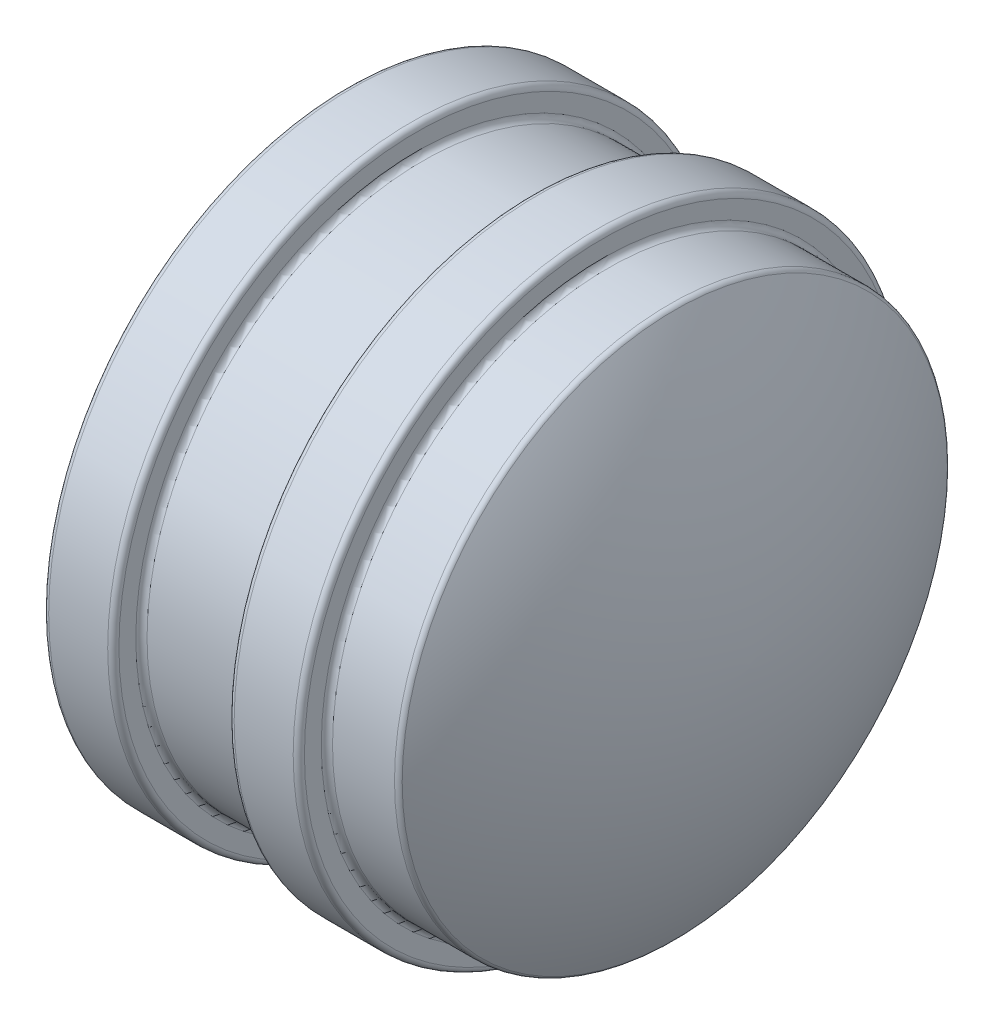
ISO-10303-21;
HEADER;
FILE_DESCRIPTION(('STEP AP214'),'2;1');
FILE_NAME('part.step','',(''),(''),'','','');
FILE_SCHEMA(('AUTOMOTIVE_DESIGN { 1 0 10303 214 1 1 1 1 }'));
ENDSEC;
DATA;
#1=APPLICATION_CONTEXT('core data for automotive mechanical design processes');
#2=APPLICATION_PROTOCOL_DEFINITION('international standard','automotive_design',2000,#1);
#3=PRODUCT_CONTEXT('',#1,'mechanical');
#4=PRODUCT('Part','Part','',(#3));
#5=PRODUCT_RELATED_PRODUCT_CATEGORY('part','',(#4));
#6=PRODUCT_DEFINITION_FORMATION('','',#4);
#7=PRODUCT_DEFINITION_CONTEXT('part definition',#1,'design');
#8=PRODUCT_DEFINITION('design','',#6,#7);
#9=PRODUCT_DEFINITION_SHAPE('','',#8);
#10=(LENGTH_UNIT() NAMED_UNIT(*) SI_UNIT(.MILLI.,.METRE.));
#11=(NAMED_UNIT(*) PLANE_ANGLE_UNIT() SI_UNIT($,.RADIAN.));
#12=(NAMED_UNIT(*) SI_UNIT($,.STERADIAN.) SOLID_ANGLE_UNIT());
#13=UNCERTAINTY_MEASURE_WITH_UNIT(LENGTH_MEASURE(1.E-05),#10,'distance_accuracy_value','');
#14=(GEOMETRIC_REPRESENTATION_CONTEXT(3) GLOBAL_UNCERTAINTY_ASSIGNED_CONTEXT((#13)) GLOBAL_UNIT_ASSIGNED_CONTEXT((#10,
#11,#12)) REPRESENTATION_CONTEXT('',''));
#15=CARTESIAN_POINT('',(0.,0.,0.));
#16=DIRECTION('',(0.,0.,1.));
#17=DIRECTION('',(1.,0.,0.));
#18=AXIS2_PLACEMENT_3D('',#15,#16,#17);
#19=CARTESIAN_POINT('',(0.,13.716,0.));
#20=DIRECTION('',(1.,0.,0.));
#21=DIRECTION('',(0.,0.,-1.));
#22=AXIS2_PLACEMENT_3D('',#19,#20,#21);
#23=PLANE('',#22);
#24=CARTESIAN_POINT('',(0.,-7.112,0.));
#25=DIRECTION('',(1.,0.,0.));
#26=DIRECTION('',(0.,0.,-1.));
#27=AXIS2_PLACEMENT_3D('',#24,#25,#26);
#28=CIRCLE('',#27,2.54);
#29=CARTESIAN_POINT('',(0.,-7.112,-2.54000000000005));
#30=VERTEX_POINT('',#29);
#31=EDGE_CURVE('E199',#30,#30,#28,.T.);
#32=ORIENTED_EDGE('',*,*,#31,.T.);
#33=EDGE_LOOP('',(#32));
#34=FACE_BOUND('',#33,.T.);
#35=CARTESIAN_POINT('',(0.,-5.02894342779868,-5.02894342779877));
#36=DIRECTION('',(1.,0.,0.));
#37=DIRECTION('',(0.,0.,-1.));
#38=AXIS2_PLACEMENT_3D('',#35,#36,#37);
#39=CIRCLE('',#38,2.54);
#40=CARTESIAN_POINT('',(0.,-5.02894342779868,-7.56894342779877));
#41=VERTEX_POINT('',#40);
#42=EDGE_CURVE('E201',#41,#41,#39,.T.);
#43=ORIENTED_EDGE('',*,*,#42,.T.);
#44=EDGE_LOOP('',(#43));
#45=FACE_BOUND('',#44,.T.);
#46=CARTESIAN_POINT('',(0.,0.,-7.112));
#47=DIRECTION('',(1.,0.,0.));
#48=DIRECTION('',(0.,0.,-1.));
#49=AXIS2_PLACEMENT_3D('',#46,#47,#48);
#50=CIRCLE('',#49,2.54);
#51=CARTESIAN_POINT('',(0.,0.,-9.652));
#52=VERTEX_POINT('',#51);
#53=EDGE_CURVE('E204',#52,#52,#50,.T.);
#54=ORIENTED_EDGE('',*,*,#53,.T.);
#55=EDGE_LOOP('',(#54));
#56=FACE_BOUND('',#55,.T.);
#57=CARTESIAN_POINT('',(0.,0.,0.));
#58=DIRECTION('',(1.,0.,0.));
#59=DIRECTION('',(0.,0.,-1.));
#60=AXIS2_PLACEMENT_3D('',#57,#58,#59);
#61=CIRCLE('',#60,2.794);
#62=CARTESIAN_POINT('',(0.,0.,-2.794));
#63=VERTEX_POINT('',#62);
#64=EDGE_CURVE('E207',#63,#63,#61,.T.);
#65=ORIENTED_EDGE('',*,*,#64,.T.);
#66=EDGE_LOOP('',(#65));
#67=FACE_BOUND('',#66,.T.);
#68=CARTESIAN_POINT('',(0.,-5.02894342779875,5.0289434277987));
#69=DIRECTION('',(1.,0.,0.));
#70=DIRECTION('',(0.,0.,-1.));
#71=AXIS2_PLACEMENT_3D('',#68,#69,#70);
#72=CIRCLE('',#71,2.54);
#73=CARTESIAN_POINT('',(0.,-5.02894342779875,2.4889434277987));
#74=VERTEX_POINT('',#73);
#75=EDGE_CURVE('E210',#74,#74,#72,.T.);
#76=ORIENTED_EDGE('',*,*,#75,.T.);
#77=EDGE_LOOP('',(#76));
#78=FACE_BOUND('',#77,.T.);
#79=CARTESIAN_POINT('',(0.,0.,7.112));
#80=DIRECTION('',(1.,0.,0.));
#81=DIRECTION('',(0.,0.,-1.));
#82=AXIS2_PLACEMENT_3D('',#79,#80,#81);
#83=CIRCLE('',#82,2.54);
#84=CARTESIAN_POINT('',(0.,0.,4.572));
#85=VERTEX_POINT('',#84);
#86=EDGE_CURVE('E213',#85,#85,#83,.T.);
#87=ORIENTED_EDGE('',*,*,#86,.T.);
#88=EDGE_LOOP('',(#87));
#89=FACE_BOUND('',#88,.T.);
#90=CARTESIAN_POINT('',(0.,5.02894342779872,5.02894342779874));
#91=DIRECTION('',(1.,0.,0.));
#92=DIRECTION('',(0.,0.,-1.));
#93=AXIS2_PLACEMENT_3D('',#90,#91,#92);
#94=CIRCLE('',#93,2.54);
#95=CARTESIAN_POINT('',(0.,5.02894342779872,2.48894342779874));
#96=VERTEX_POINT('',#95);
#97=EDGE_CURVE('E216',#96,#96,#94,.T.);
#98=ORIENTED_EDGE('',*,*,#97,.T.);
#99=EDGE_LOOP('',(#98));
#100=FACE_BOUND('',#99,.T.);
#101=CARTESIAN_POINT('',(0.,7.112,0.));
#102=DIRECTION('',(1.,0.,0.));
#103=DIRECTION('',(0.,0.,-1.));
#104=AXIS2_PLACEMENT_3D('',#101,#102,#103);
#105=CIRCLE('',#104,2.54);
#106=CARTESIAN_POINT('',(0.,7.112,-2.54));
#107=VERTEX_POINT('',#106);
#108=EDGE_CURVE('E176',#107,#107,#105,.T.);
#109=ORIENTED_EDGE('',*,*,#108,.T.);
#110=EDGE_LOOP('',(#109));
#111=FACE_BOUND('',#110,.T.);
#112=CARTESIAN_POINT('',(0.,5.02894342779879,-5.02894342779866));
#113=DIRECTION('',(1.,0.,0.));
#114=DIRECTION('',(0.,0.,-1.));
#115=AXIS2_PLACEMENT_3D('',#112,#113,#114);
#116=CIRCLE('',#115,2.54);
#117=CARTESIAN_POINT('',(0.,5.02894342779879,-7.56894342779866));
#118=VERTEX_POINT('',#117);
#119=EDGE_CURVE('E220',#118,#118,#116,.T.);
#120=ORIENTED_EDGE('',*,*,#119,.T.);
#121=EDGE_LOOP('',(#120));
#122=FACE_BOUND('',#121,.T.);
#123=CARTESIAN_POINT('',(0.,0.,0.));
#124=DIRECTION('',(1.,0.,0.));
#125=DIRECTION('',(0.,0.,-1.));
#126=AXIS2_PLACEMENT_3D('',#123,#124,#125);
#127=CIRCLE('',#126,13.462);
#128=CARTESIAN_POINT('',(0.,0.,-13.462));
#129=VERTEX_POINT('',#128);
#130=EDGE_CURVE('E280',#129,#129,#127,.F.);
#131=ORIENTED_EDGE('',*,*,#130,.T.);
#132=EDGE_LOOP('',(#131));
#133=FACE_BOUND('',#132,.T.);
#134=ADVANCED_FACE('F32',(#34,#45,#56,#67,#78,#89,#100,#111,#122,#133),#23,.F.);
#135=CARTESIAN_POINT('',(0.,0.,0.));
#136=DIRECTION('',(-1.,0.,0.));
#137=DIRECTION('',(0.,0.,1.));
#138=AXIS2_PLACEMENT_3D('',#135,#136,#137);
#139=CYLINDRICAL_SURFACE('',#138,13.716);
#140=CARTESIAN_POINT('',(2.921,0.,0.));
#141=DIRECTION('',(-1.,0.,0.));
#142=DIRECTION('',(0.,0.,1.));
#143=AXIS2_PLACEMENT_3D('',#140,#141,#142);
#144=CIRCLE('',#143,13.716);
#145=CARTESIAN_POINT('',(2.921,0.,13.716));
#146=VERTEX_POINT('',#145);
#147=EDGE_CURVE('E283',#146,#146,#144,.T.);
#148=ORIENTED_EDGE('',*,*,#147,.T.);
#149=EDGE_LOOP('',(#148));
#150=FACE_BOUND('',#149,.T.);
#151=CARTESIAN_POINT('',(0.25399999999999,0.,0.));
#152=DIRECTION('',(1.,0.,0.));
#153=DIRECTION('',(0.,0.,-1.));
#154=AXIS2_PLACEMENT_3D('',#151,#152,#153);
#155=CIRCLE('',#154,13.716);
#156=CARTESIAN_POINT('',(0.25399999999999,0.,-13.716));
#157=VERTEX_POINT('',#156);
#158=EDGE_CURVE('E286',#157,#157,#155,.T.);
#159=ORIENTED_EDGE('',*,*,#158,.T.);
#160=EDGE_LOOP('',(#159));
#161=FACE_BOUND('',#160,.T.);
#162=ADVANCED_FACE('F61',(#150,#161),#139,.T.);
#163=CARTESIAN_POINT('',(3.175,12.446,0.));
#164=DIRECTION('',(-1.,0.,0.));
#165=DIRECTION('',(0.,0.,1.));
#166=AXIS2_PLACEMENT_3D('',#163,#164,#165);
#167=PLANE('',#166);
#168=CARTESIAN_POINT('',(3.175,0.,0.));
#169=DIRECTION('',(-1.,0.,0.));
#170=DIRECTION('',(0.,0.,1.));
#171=AXIS2_PLACEMENT_3D('',#168,#169,#170);
#172=CIRCLE('',#171,12.7);
#173=CARTESIAN_POINT('',(3.175,0.,12.7));
#174=VERTEX_POINT('',#173);
#175=EDGE_CURVE('E289',#174,#174,#172,.T.);
#176=ORIENTED_EDGE('',*,*,#175,.T.);
#177=EDGE_LOOP('',(#176));
#178=FACE_BOUND('',#177,.T.);
#179=CARTESIAN_POINT('',(3.175,0.,0.));
#180=DIRECTION('',(-1.,0.,0.));
#181=DIRECTION('',(0.,0.,1.));
#182=AXIS2_PLACEMENT_3D('',#179,#180,#181);
#183=CIRCLE('',#182,13.462);
#184=CARTESIAN_POINT('',(3.175,0.,13.462));
#185=VERTEX_POINT('',#184);
#186=EDGE_CURVE('E292',#185,#185,#183,.F.);
#187=ORIENTED_EDGE('',*,*,#186,.T.);
#188=EDGE_LOOP('',(#187));
#189=FACE_BOUND('',#188,.T.);
#190=ADVANCED_FACE('F67',(#178,#189),#167,.F.);
#191=CARTESIAN_POINT('',(0.,0.,0.));
#192=DIRECTION('',(-1.,0.,0.));
#193=DIRECTION('',(0.,0.,1.));
#194=AXIS2_PLACEMENT_3D('',#191,#192,#193);
#195=CYLINDRICAL_SURFACE('',#194,12.446);
#196=CARTESIAN_POINT('',(8.128,0.,0.));
#197=DIRECTION('',(1.,0.,0.));
#198=DIRECTION('',(0.,0.,-1.));
#199=AXIS2_PLACEMENT_3D('',#196,#197,#198);
#200=CIRCLE('',#199,12.446);
#201=CARTESIAN_POINT('',(8.128,0.,-12.446));
#202=VERTEX_POINT('',#201);
#203=EDGE_CURVE('E295',#202,#202,#200,.F.);
#204=ORIENTED_EDGE('',*,*,#203,.T.);
#205=EDGE_LOOP('',(#204));
#206=FACE_BOUND('',#205,.T.);
#207=CARTESIAN_POINT('',(3.429,0.,0.));
#208=DIRECTION('',(-1.,0.,0.));
#209=DIRECTION('',(0.,0.,1.));
#210=AXIS2_PLACEMENT_3D('',#207,#208,#209);
#211=CIRCLE('',#210,12.446);
#212=CARTESIAN_POINT('',(3.429,0.,12.446));
#213=VERTEX_POINT('',#212);
#214=EDGE_CURVE('E298',#213,#213,#211,.F.);
#215=ORIENTED_EDGE('',*,*,#214,.T.);
#216=EDGE_LOOP('',(#215));
#217=FACE_BOUND('',#216,.T.);
#218=ADVANCED_FACE('F349',(#206,#217),#195,.T.);
#219=CARTESIAN_POINT('',(8.382,13.716,0.));
#220=DIRECTION('',(1.,0.,0.));
#221=DIRECTION('',(0.,0.,-1.));
#222=AXIS2_PLACEMENT_3D('',#219,#220,#221);
#223=PLANE('',#222);
#224=CARTESIAN_POINT('',(8.382,0.,0.));
#225=DIRECTION('',(1.,0.,0.));
#226=DIRECTION('',(0.,0.,-1.));
#227=AXIS2_PLACEMENT_3D('',#224,#225,#226);
#228=CIRCLE('',#227,13.462);
#229=CARTESIAN_POINT('',(8.382,0.,-13.462));
#230=VERTEX_POINT('',#229);
#231=EDGE_CURVE('E301',#230,#230,#228,.F.);
#232=ORIENTED_EDGE('',*,*,#231,.T.);
#233=EDGE_LOOP('',(#232));
#234=FACE_BOUND('',#233,.T.);
#235=CARTESIAN_POINT('',(8.382,0.,0.));
#236=DIRECTION('',(1.,0.,0.));
#237=DIRECTION('',(0.,0.,-1.));
#238=AXIS2_PLACEMENT_3D('',#235,#236,#237);
#239=CIRCLE('',#238,12.7);
#240=CARTESIAN_POINT('',(8.382,0.,-12.7));
#241=VERTEX_POINT('',#240);
#242=EDGE_CURVE('E304',#241,#241,#239,.T.);
#243=ORIENTED_EDGE('',*,*,#242,.T.);
#244=EDGE_LOOP('',(#243));
#245=FACE_BOUND('',#244,.T.);
#246=ADVANCED_FACE('F341',(#234,#245),#223,.F.);
#247=CARTESIAN_POINT('',(0.,0.,0.));
#248=DIRECTION('',(-1.,0.,0.));
#249=DIRECTION('',(0.,0.,1.));
#250=AXIS2_PLACEMENT_3D('',#247,#248,#249);
#251=CYLINDRICAL_SURFACE('',#250,13.716);
#252=CARTESIAN_POINT('',(11.303,0.,0.));
#253=DIRECTION('',(-1.,0.,0.));
#254=DIRECTION('',(0.,0.,1.));
#255=AXIS2_PLACEMENT_3D('',#252,#253,#254);
#256=CIRCLE('',#255,13.716);
#257=CARTESIAN_POINT('',(11.303,0.,13.716));
#258=VERTEX_POINT('',#257);
#259=EDGE_CURVE('E307',#258,#258,#256,.T.);
#260=ORIENTED_EDGE('',*,*,#259,.T.);
#261=EDGE_LOOP('',(#260));
#262=FACE_BOUND('',#261,.T.);
#263=CARTESIAN_POINT('',(8.636,0.,0.));
#264=DIRECTION('',(1.,0.,0.));
#265=DIRECTION('',(0.,0.,-1.));
#266=AXIS2_PLACEMENT_3D('',#263,#264,#265);
#267=CIRCLE('',#266,13.716);
#268=CARTESIAN_POINT('',(8.636,0.,-13.716));
#269=VERTEX_POINT('',#268);
#270=EDGE_CURVE('E310',#269,#269,#267,.T.);
#271=ORIENTED_EDGE('',*,*,#270,.T.);
#272=EDGE_LOOP('',(#271));
#273=FACE_BOUND('',#272,.T.);
#274=ADVANCED_FACE('F333',(#262,#273),#251,.T.);
#275=CARTESIAN_POINT('',(11.557,12.446,0.));
#276=DIRECTION('',(-1.,0.,0.));
#277=DIRECTION('',(0.,0.,1.));
#278=AXIS2_PLACEMENT_3D('',#275,#276,#277);
#279=PLANE('',#278);
#280=CARTESIAN_POINT('',(11.557,0.,0.));
#281=DIRECTION('',(-1.,0.,0.));
#282=DIRECTION('',(0.,0.,1.));
#283=AXIS2_PLACEMENT_3D('',#280,#281,#282);
#284=CIRCLE('',#283,12.7);
#285=CARTESIAN_POINT('',(11.557,0.,12.7));
#286=VERTEX_POINT('',#285);
#287=EDGE_CURVE('E313',#286,#286,#284,.T.);
#288=ORIENTED_EDGE('',*,*,#287,.T.);
#289=EDGE_LOOP('',(#288));
#290=FACE_BOUND('',#289,.T.);
#291=CARTESIAN_POINT('',(11.557,0.,0.));
#292=DIRECTION('',(-1.,0.,0.));
#293=DIRECTION('',(0.,0.,1.));
#294=AXIS2_PLACEMENT_3D('',#291,#292,#293);
#295=CIRCLE('',#294,13.462);
#296=CARTESIAN_POINT('',(11.557,0.,13.462));
#297=VERTEX_POINT('',#296);
#298=EDGE_CURVE('E316',#297,#297,#295,.F.);
#299=ORIENTED_EDGE('',*,*,#298,.T.);
#300=EDGE_LOOP('',(#299));
#301=FACE_BOUND('',#300,.T.);
#302=ADVANCED_FACE('F55',(#290,#301),#279,.F.);
#303=CARTESIAN_POINT('',(0.,0.,0.));
#304=DIRECTION('',(-1.,0.,0.));
#305=DIRECTION('',(0.,0.,1.));
#306=AXIS2_PLACEMENT_3D('',#303,#304,#305);
#307=CYLINDRICAL_SURFACE('',#306,12.446);
#308=CARTESIAN_POINT('',(14.6106330774353,0.,0.));
#309=DIRECTION('',(1.,0.,0.));
#310=DIRECTION('',(0.,0.,-1.));
#311=AXIS2_PLACEMENT_3D('',#308,#309,#310);
#312=CIRCLE('',#311,12.446);
#313=CARTESIAN_POINT('',(14.6106330774353,0.,-12.446));
#314=VERTEX_POINT('',#313);
#315=EDGE_CURVE('E321',#314,#314,#312,.F.);
#316=ORIENTED_EDGE('',*,*,#315,.T.);
#317=EDGE_LOOP('',(#316));
#318=FACE_BOUND('',#317,.T.);
#319=CARTESIAN_POINT('',(11.811,0.,0.));
#320=DIRECTION('',(-1.,0.,0.));
#321=DIRECTION('',(0.,0.,1.));
#322=AXIS2_PLACEMENT_3D('',#319,#320,#321);
#323=CIRCLE('',#322,12.446);
#324=CARTESIAN_POINT('',(11.811,0.,12.446));
#325=VERTEX_POINT('',#324);
#326=EDGE_CURVE('E324',#325,#325,#323,.F.);
#327=ORIENTED_EDGE('',*,*,#326,.T.);
#328=EDGE_LOOP('',(#327));
#329=FACE_BOUND('',#328,.T.);
#330=ADVANCED_FACE('F45',(#318,#329),#307,.T.);
#331=CARTESIAN_POINT('',(-7.21180336977641,0.,-0.302101948815966));
#332=DIRECTION('',(0.,-1.,0.));
#333=DIRECTION('',(0.,0.,1.));
#334=AXIS2_PLACEMENT_3D('',#331,#332,#333);
#335=CIRCLE('',#334,25.4);
#336=TRIMMED_CURVE('',#335,(PARAMETER_VALUE(-1.55890226884512)),
(PARAMETER_VALUE(1.55890226884512)),.T.,.PARAMETER.);
#337=CARTESIAN_POINT('',(-7.21180336977641,0.,0.));
#338=DIRECTION('',(-1.,0.,0.));
#339=AXIS1_PLACEMENT('',#337,#338);
#340=SURFACE_OF_REVOLUTION('',#336,#339);
#341=CARTESIAN_POINT('',(14.8310617284172,0.,0.));
#342=DIRECTION('',(-1.,0.,0.));
#343=DIRECTION('',(0.,0.,1.));
#344=AXIS2_PLACEMENT_3D('',#341,#342,#343);
#345=CIRCLE('',#344,12.3182030499881);
#346=CARTESIAN_POINT('',(14.8310617284172,0.,12.3182030499881));
#347=VERTEX_POINT('',#346);
#348=EDGE_CURVE('E319',#347,#347,#345,.F.);
#349=ORIENTED_EDGE('',*,*,#348,.T.);
#350=EDGE_LOOP('',(#349));
#351=FACE_BOUND('',#350,.T.);
#352=CARTESIAN_POINT('',(18.1864,0.,0.));
#353=VERTEX_POINT('',#352);
#354=VERTEX_LOOP('',#353);
#355=FACE_BOUND('',#354,.T.);
#356=ADVANCED_FACE('F42',(#351,#355),#340,.T.);
#357=CARTESIAN_POINT('',(14.6106330774353,0.,0.));
#358=DIRECTION('',(1.,0.,0.));
#359=DIRECTION('',(0.,0.,-1.));
#360=AXIS2_PLACEMENT_3D('',#357,#358,#359);
#361=TOROIDAL_SURFACE('',#360,12.192,0.254);
#362=ORIENTED_EDGE('',*,*,#348,.F.);
#363=EDGE_LOOP('',(#362));
#364=FACE_BOUND('',#363,.T.);
#365=ORIENTED_EDGE('',*,*,#315,.F.);
#366=EDGE_LOOP('',(#365));
#367=FACE_BOUND('',#366,.T.);
#368=ADVANCED_FACE('F44',(#364,#367),#361,.T.);
#369=CARTESIAN_POINT('',(11.811,0.,0.));
#370=DIRECTION('',(-1.,0.,0.));
#371=DIRECTION('',(0.,0.,1.));
#372=AXIS2_PLACEMENT_3D('',#369,#370,#371);
#373=TOROIDAL_SURFACE('',#372,12.7,0.254);
#374=ORIENTED_EDGE('',*,*,#326,.F.);
#375=EDGE_LOOP('',(#374));
#376=FACE_BOUND('',#375,.T.);
#377=ORIENTED_EDGE('',*,*,#287,.F.);
#378=EDGE_LOOP('',(#377));
#379=FACE_BOUND('',#378,.T.);
#380=ADVANCED_FACE('F52',(#376,#379),#373,.F.);
#381=CARTESIAN_POINT('',(11.303,0.,0.));
#382=DIRECTION('',(-1.,0.,0.));
#383=DIRECTION('',(0.,0.,1.));
#384=AXIS2_PLACEMENT_3D('',#381,#382,#383);
#385=TOROIDAL_SURFACE('',#384,13.462,0.254);
#386=ORIENTED_EDGE('',*,*,#298,.F.);
#387=EDGE_LOOP('',(#386));
#388=FACE_BOUND('',#387,.T.);
#389=ORIENTED_EDGE('',*,*,#259,.F.);
#390=EDGE_LOOP('',(#389));
#391=FACE_BOUND('',#390,.T.);
#392=ADVANCED_FACE('F76',(#388,#391),#385,.T.);
#393=CARTESIAN_POINT('',(8.636,0.,0.));
#394=DIRECTION('',(1.,0.,0.));
#395=DIRECTION('',(0.,0.,-1.));
#396=AXIS2_PLACEMENT_3D('',#393,#394,#395);
#397=TOROIDAL_SURFACE('',#396,13.462,0.254);
#398=ORIENTED_EDGE('',*,*,#270,.F.);
#399=EDGE_LOOP('',(#398));
#400=FACE_BOUND('',#399,.T.);
#401=ORIENTED_EDGE('',*,*,#231,.F.);
#402=EDGE_LOOP('',(#401));
#403=FACE_BOUND('',#402,.T.);
#404=ADVANCED_FACE('F80',(#400,#403),#397,.T.);
#405=CARTESIAN_POINT('',(8.128,0.,0.));
#406=DIRECTION('',(1.,0.,0.));
#407=DIRECTION('',(0.,0.,-1.));
#408=AXIS2_PLACEMENT_3D('',#405,#406,#407);
#409=TOROIDAL_SURFACE('',#408,12.7,0.254);
#410=ORIENTED_EDGE('',*,*,#242,.F.);
#411=EDGE_LOOP('',(#410));
#412=FACE_BOUND('',#411,.T.);
#413=ORIENTED_EDGE('',*,*,#203,.F.);
#414=EDGE_LOOP('',(#413));
#415=FACE_BOUND('',#414,.T.);
#416=ADVANCED_FACE('F84',(#412,#415),#409,.F.);
#417=CARTESIAN_POINT('',(3.429,0.,0.));
#418=DIRECTION('',(-1.,0.,0.));
#419=DIRECTION('',(0.,0.,1.));
#420=AXIS2_PLACEMENT_3D('',#417,#418,#419);
#421=TOROIDAL_SURFACE('',#420,12.7,0.254);
#422=ORIENTED_EDGE('',*,*,#214,.F.);
#423=EDGE_LOOP('',(#422));
#424=FACE_BOUND('',#423,.T.);
#425=ORIENTED_EDGE('',*,*,#175,.F.);
#426=EDGE_LOOP('',(#425));
#427=FACE_BOUND('',#426,.T.);
#428=ADVANCED_FACE('F88',(#424,#427),#421,.F.);
#429=CARTESIAN_POINT('',(2.921,0.,0.));
#430=DIRECTION('',(-1.,0.,0.));
#431=DIRECTION('',(0.,0.,1.));
#432=AXIS2_PLACEMENT_3D('',#429,#430,#431);
#433=TOROIDAL_SURFACE('',#432,13.462,0.254);
#434=ORIENTED_EDGE('',*,*,#186,.F.);
#435=EDGE_LOOP('',(#434));
#436=FACE_BOUND('',#435,.T.);
#437=ORIENTED_EDGE('',*,*,#147,.F.);
#438=EDGE_LOOP('',(#437));
#439=FACE_BOUND('',#438,.T.);
#440=ADVANCED_FACE('F92',(#436,#439),#433,.T.);
#441=CARTESIAN_POINT('',(0.25399999999999,0.,0.));
#442=DIRECTION('',(1.,0.,0.));
#443=DIRECTION('',(0.,0.,-1.));
#444=AXIS2_PLACEMENT_3D('',#441,#442,#443);
#445=TOROIDAL_SURFACE('',#444,13.462,0.254);
#446=ORIENTED_EDGE('',*,*,#158,.F.);
#447=EDGE_LOOP('',(#446));
#448=FACE_BOUND('',#447,.T.);
#449=ORIENTED_EDGE('',*,*,#130,.F.);
#450=EDGE_LOOP('',(#449));
#451=FACE_BOUND('',#450,.T.);
#452=ADVANCED_FACE('F96',(#448,#451),#445,.T.);
#453=CARTESIAN_POINT('',(6.35,0.,0.));
#454=DIRECTION('',(-1.,0.,0.));
#455=DIRECTION('',(0.,0.,1.));
#456=AXIS2_PLACEMENT_3D('',#453,#454,#455);
#457=CYLINDRICAL_SURFACE('',#456,2.54);
#458=CARTESIAN_POINT('',(0.253999999999989,0.,0.));
#459=DIRECTION('',(1.,0.,0.));
#460=DIRECTION('',(0.,0.,-1.));
#461=AXIS2_PLACEMENT_3D('',#458,#459,#460);
#462=CIRCLE('',#461,2.54);
#463=CARTESIAN_POINT('',(0.253999999999989,0.,-2.54));
#464=VERTEX_POINT('',#463);
#465=EDGE_CURVE('E190',#464,#464,#462,.F.);
#466=ORIENTED_EDGE('',*,*,#465,.T.);
#467=EDGE_LOOP('',(#466));
#468=FACE_BOUND('',#467,.T.);
#469=CARTESIAN_POINT('',(5.08,0.,0.));
#470=DIRECTION('',(-1.,0.,0.));
#471=DIRECTION('',(0.,0.,1.));
#472=AXIS2_PLACEMENT_3D('',#469,#470,#471);
#473=CIRCLE('',#472,2.54);
#474=CARTESIAN_POINT('',(5.08,0.,2.54));
#475=VERTEX_POINT('',#474);
#476=EDGE_CURVE('E250',#475,#475,#473,.F.);
#477=ORIENTED_EDGE('',*,*,#476,.T.);
#478=EDGE_LOOP('',(#477));
#479=FACE_BOUND('',#478,.T.);
#480=ADVANCED_FACE('F100',(#468,#479),#457,.F.);
#481=CARTESIAN_POINT('',(6.35,0.,0.));
#482=DIRECTION('',(-1.,0.,0.));
#483=DIRECTION('',(0.,0.,1.));
#484=AXIS2_PLACEMENT_3D('',#481,#482,#483);
#485=PLANE('',#484);
#486=CARTESIAN_POINT('',(6.35,0.,0.));
#487=DIRECTION('',(-1.,0.,0.));
#488=DIRECTION('',(0.,0.,1.));
#489=AXIS2_PLACEMENT_3D('',#486,#487,#488);
#490=CIRCLE('',#489,1.27);
#491=CARTESIAN_POINT('',(6.35,0.,1.27));
#492=VERTEX_POINT('',#491);
#493=EDGE_CURVE('E253',#492,#492,#490,.T.);
#494=ORIENTED_EDGE('',*,*,#493,.T.);
#495=EDGE_LOOP('',(#494));
#496=FACE_BOUND('',#495,.T.);
#497=ADVANCED_FACE('F455',(#496),#485,.T.);
#498=CARTESIAN_POINT('',(6.35,7.112,0.));
#499=DIRECTION('',(-1.,0.,0.));
#500=DIRECTION('',(0.,0.,1.));
#501=AXIS2_PLACEMENT_3D('',#498,#499,#500);
#502=CYLINDRICAL_SURFACE('',#501,2.286);
#503=CARTESIAN_POINT('',(0.253999999999989,7.112,0.));
#504=DIRECTION('',(1.,0.,0.));
#505=DIRECTION('',(0.,0.,-1.));
#506=AXIS2_PLACEMENT_3D('',#503,#504,#505);
#507=CIRCLE('',#506,2.286);
#508=CARTESIAN_POINT('',(0.253999999999989,7.112,-2.286));
#509=VERTEX_POINT('',#508);
#510=EDGE_CURVE('E39',#509,#509,#507,.F.);
#511=ORIENTED_EDGE('',*,*,#510,.T.);
#512=EDGE_LOOP('',(#511));
#513=FACE_BOUND('',#512,.T.);
#514=CARTESIAN_POINT('',(5.08,7.112,0.));
#515=DIRECTION('',(-1.,0.,0.));
#516=DIRECTION('',(0.,0.,1.));
#517=AXIS2_PLACEMENT_3D('',#514,#515,#516);
#518=CIRCLE('',#517,2.286);
#519=CARTESIAN_POINT('',(5.08,7.112,2.286));
#520=VERTEX_POINT('',#519);
#521=EDGE_CURVE('E232',#520,#520,#518,.F.);
#522=ORIENTED_EDGE('',*,*,#521,.T.);
#523=EDGE_LOOP('',(#522));
#524=FACE_BOUND('',#523,.T.);
#525=ADVANCED_FACE('F460',(#513,#524),#502,.F.);
#526=CARTESIAN_POINT('',(6.35,7.112,0.));
#527=DIRECTION('',(-1.,0.,0.));
#528=DIRECTION('',(0.,0.,1.));
#529=AXIS2_PLACEMENT_3D('',#526,#527,#528);
#530=PLANE('',#529);
#531=CARTESIAN_POINT('',(6.35,7.112,0.));
#532=DIRECTION('',(-1.,0.,0.));
#533=DIRECTION('',(0.,0.,1.));
#534=AXIS2_PLACEMENT_3D('',#531,#532,#533);
#535=CIRCLE('',#534,1.016);
#536=CARTESIAN_POINT('',(6.35,7.112,1.016));
#537=VERTEX_POINT('',#536);
#538=EDGE_CURVE('E235',#537,#537,#535,.T.);
#539=ORIENTED_EDGE('',*,*,#538,.T.);
#540=EDGE_LOOP('',(#539));
#541=FACE_BOUND('',#540,.T.);
#542=ADVANCED_FACE('F468',(#541),#530,.T.);
#543=CARTESIAN_POINT('',(6.35,5.02894342779872,5.02894342779874));
#544=DIRECTION('',(-1.,0.,0.));
#545=DIRECTION('',(0.,0.,1.));
#546=AXIS2_PLACEMENT_3D('',#543,#544,#545);
#547=CYLINDRICAL_SURFACE('',#546,2.286);
#548=CARTESIAN_POINT('',(0.253999999999989,5.02894342779872,5.02894342779874));
#549=DIRECTION('',(1.,0.,0.));
#550=DIRECTION('',(0.,0.,-1.));
#551=AXIS2_PLACEMENT_3D('',#548,#549,#550);
#552=CIRCLE('',#551,2.286);
#553=CARTESIAN_POINT('',(0.253999999999989,5.02894342779872,2.74294342779874));
#554=VERTEX_POINT('',#553);
#555=EDGE_CURVE('E180',#554,#554,#552,.F.);
#556=ORIENTED_EDGE('',*,*,#555,.T.);
#557=EDGE_LOOP('',(#556));
#558=FACE_BOUND('',#557,.T.);
#559=CARTESIAN_POINT('',(5.08,5.02894342779872,5.02894342779874));
#560=DIRECTION('',(-1.,0.,0.));
#561=DIRECTION('',(0.,0.,1.));
#562=AXIS2_PLACEMENT_3D('',#559,#560,#561);
#563=CIRCLE('',#562,2.286);
#564=CARTESIAN_POINT('',(5.08,5.02894342779872,7.31494342779873));
#565=VERTEX_POINT('',#564);
#566=EDGE_CURVE('E256',#565,#565,#563,.F.);
#567=ORIENTED_EDGE('',*,*,#566,.T.);
#568=EDGE_LOOP('',(#567));
#569=FACE_BOUND('',#568,.T.);
#570=ADVANCED_FACE('F473',(#558,#569),#547,.F.);
#571=CARTESIAN_POINT('',(6.35,5.02894342779872,5.02894342779874));
#572=DIRECTION('',(-1.,0.,0.));
#573=DIRECTION('',(0.,0.,1.));
#574=AXIS2_PLACEMENT_3D('',#571,#572,#573);
#575=PLANE('',#574);
#576=CARTESIAN_POINT('',(6.35,5.02894342779872,5.02894342779874));
#577=DIRECTION('',(-1.,0.,0.));
#578=DIRECTION('',(0.,0.,1.));
#579=AXIS2_PLACEMENT_3D('',#576,#577,#578);
#580=CIRCLE('',#579,1.016);
#581=CARTESIAN_POINT('',(6.35,5.02894342779872,6.04494342779873));
#582=VERTEX_POINT('',#581);
#583=EDGE_CURVE('E259',#582,#582,#580,.T.);
#584=ORIENTED_EDGE('',*,*,#583,.T.);
#585=EDGE_LOOP('',(#584));
#586=FACE_BOUND('',#585,.T.);
#587=ADVANCED_FACE('F481',(#586),#575,.T.);
#588=CARTESIAN_POINT('',(6.35,0.,7.112));
#589=DIRECTION('',(-1.,0.,0.));
#590=DIRECTION('',(0.,0.,1.));
#591=AXIS2_PLACEMENT_3D('',#588,#589,#590);
#592=CYLINDRICAL_SURFACE('',#591,2.286);
#593=CARTESIAN_POINT('',(0.253999999999989,0.,7.112));
#594=DIRECTION('',(1.,0.,0.));
#595=DIRECTION('',(0.,0.,-1.));
#596=AXIS2_PLACEMENT_3D('',#593,#594,#595);
#597=CIRCLE('',#596,2.286);
#598=CARTESIAN_POINT('',(0.253999999999989,0.,4.826));
#599=VERTEX_POINT('',#598);
#600=EDGE_CURVE('E182',#599,#599,#597,.F.);
#601=ORIENTED_EDGE('',*,*,#600,.T.);
#602=EDGE_LOOP('',(#601));
#603=FACE_BOUND('',#602,.T.);
#604=CARTESIAN_POINT('',(5.08,0.,7.112));
#605=DIRECTION('',(-1.,0.,0.));
#606=DIRECTION('',(0.,0.,1.));
#607=AXIS2_PLACEMENT_3D('',#604,#605,#606);
#608=CIRCLE('',#607,2.286);
#609=CARTESIAN_POINT('',(5.08,0.,9.398));
#610=VERTEX_POINT('',#609);
#611=EDGE_CURVE('E262',#610,#610,#608,.F.);
#612=ORIENTED_EDGE('',*,*,#611,.T.);
#613=EDGE_LOOP('',(#612));
#614=FACE_BOUND('',#613,.T.);
#615=ADVANCED_FACE('F486',(#603,#614),#592,.F.);
#616=CARTESIAN_POINT('',(6.35,0.,7.112));
#617=DIRECTION('',(-1.,0.,0.));
#618=DIRECTION('',(0.,0.,1.));
#619=AXIS2_PLACEMENT_3D('',#616,#617,#618);
#620=PLANE('',#619);
#621=CARTESIAN_POINT('',(6.35,0.,7.112));
#622=DIRECTION('',(-1.,0.,0.));
#623=DIRECTION('',(0.,0.,1.));
#624=AXIS2_PLACEMENT_3D('',#621,#622,#623);
#625=CIRCLE('',#624,1.016);
#626=CARTESIAN_POINT('',(6.35,0.,8.128));
#627=VERTEX_POINT('',#626);
#628=EDGE_CURVE('E265',#627,#627,#625,.T.);
#629=ORIENTED_EDGE('',*,*,#628,.T.);
#630=EDGE_LOOP('',(#629));
#631=FACE_BOUND('',#630,.T.);
#632=ADVANCED_FACE('F494',(#631),#620,.T.);
#633=CARTESIAN_POINT('',(6.35,-5.02894342779875,5.0289434277987));
#634=DIRECTION('',(-1.,0.,0.));
#635=DIRECTION('',(0.,0.,1.));
#636=AXIS2_PLACEMENT_3D('',#633,#634,#635);
#637=CYLINDRICAL_SURFACE('',#636,2.286);
#638=CARTESIAN_POINT('',(0.253999999999989,-5.02894342779875,5.0289434277987));
#639=DIRECTION('',(1.,0.,0.));
#640=DIRECTION('',(0.,0.,-1.));
#641=AXIS2_PLACEMENT_3D('',#638,#639,#640);
#642=CIRCLE('',#641,2.286);
#643=CARTESIAN_POINT('',(0.253999999999989,-5.02894342779875,2.7429434277987));
#644=VERTEX_POINT('',#643);
#645=EDGE_CURVE('E187',#644,#644,#642,.F.);
#646=ORIENTED_EDGE('',*,*,#645,.T.);
#647=EDGE_LOOP('',(#646));
#648=FACE_BOUND('',#647,.T.);
#649=CARTESIAN_POINT('',(5.08,-5.02894342779875,5.0289434277987));
#650=DIRECTION('',(-1.,0.,0.));
#651=DIRECTION('',(0.,0.,1.));
#652=AXIS2_PLACEMENT_3D('',#649,#650,#651);
#653=CIRCLE('',#652,2.286);
#654=CARTESIAN_POINT('',(5.08,-5.02894342779875,7.3149434277987));
#655=VERTEX_POINT('',#654);
#656=EDGE_CURVE('E268',#655,#655,#653,.F.);
#657=ORIENTED_EDGE('',*,*,#656,.T.);
#658=EDGE_LOOP('',(#657));
#659=FACE_BOUND('',#658,.T.);
#660=ADVANCED_FACE('F499',(#648,#659),#637,.F.);
#661=CARTESIAN_POINT('',(6.35,-5.02894342779875,5.0289434277987));
#662=DIRECTION('',(-1.,0.,0.));
#663=DIRECTION('',(0.,0.,1.));
#664=AXIS2_PLACEMENT_3D('',#661,#662,#663);
#665=PLANE('',#664);
#666=CARTESIAN_POINT('',(6.35,-5.02894342779875,5.0289434277987));
#667=DIRECTION('',(-1.,0.,0.));
#668=DIRECTION('',(0.,0.,1.));
#669=AXIS2_PLACEMENT_3D('',#666,#667,#668);
#670=CIRCLE('',#669,1.016);
#671=CARTESIAN_POINT('',(6.35,-5.02894342779875,6.0449434277987));
#672=VERTEX_POINT('',#671);
#673=EDGE_CURVE('E271',#672,#672,#670,.T.);
#674=ORIENTED_EDGE('',*,*,#673,.T.);
#675=EDGE_LOOP('',(#674));
#676=FACE_BOUND('',#675,.T.);
#677=ADVANCED_FACE('F507',(#676),#665,.T.);
#678=CARTESIAN_POINT('',(6.35,-7.112,0.));
#679=DIRECTION('',(-1.,0.,0.));
#680=DIRECTION('',(0.,0.,1.));
#681=AXIS2_PLACEMENT_3D('',#678,#679,#680);
#682=CYLINDRICAL_SURFACE('',#681,2.286);
#683=CARTESIAN_POINT('',(0.253999999999989,-7.112,0.));
#684=DIRECTION('',(1.,0.,0.));
#685=DIRECTION('',(0.,0.,-1.));
#686=AXIS2_PLACEMENT_3D('',#683,#684,#685);
#687=CIRCLE('',#686,2.286);
#688=CARTESIAN_POINT('',(0.253999999999989,-7.112,-2.28600000000005));
#689=VERTEX_POINT('',#688);
#690=EDGE_CURVE('E223',#689,#689,#687,.F.);
#691=ORIENTED_EDGE('',*,*,#690,.T.);
#692=EDGE_LOOP('',(#691));
#693=FACE_BOUND('',#692,.T.);
#694=CARTESIAN_POINT('',(5.08,-7.112,0.));
#695=DIRECTION('',(-1.,0.,0.));
#696=DIRECTION('',(0.,0.,1.));
#697=AXIS2_PLACEMENT_3D('',#694,#695,#696);
#698=CIRCLE('',#697,2.286);
#699=CARTESIAN_POINT('',(5.08,-7.112,2.28599999999995));
#700=VERTEX_POINT('',#699);
#701=EDGE_CURVE('E274',#700,#700,#698,.F.);
#702=ORIENTED_EDGE('',*,*,#701,.T.);
#703=EDGE_LOOP('',(#702));
#704=FACE_BOUND('',#703,.T.);
#705=ADVANCED_FACE('F512',(#693,#704),#682,.F.);
#706=CARTESIAN_POINT('',(6.35,-7.112,0.));
#707=DIRECTION('',(-1.,0.,0.));
#708=DIRECTION('',(0.,0.,1.));
#709=AXIS2_PLACEMENT_3D('',#706,#707,#708);
#710=PLANE('',#709);
#711=CARTESIAN_POINT('',(6.35,-7.112,0.));
#712=DIRECTION('',(-1.,0.,0.));
#713=DIRECTION('',(0.,0.,1.));
#714=AXIS2_PLACEMENT_3D('',#711,#712,#713);
#715=CIRCLE('',#714,1.016);
#716=CARTESIAN_POINT('',(6.35,-7.112,1.01599999999995));
#717=VERTEX_POINT('',#716);
#718=EDGE_CURVE('E277',#717,#717,#715,.T.);
#719=ORIENTED_EDGE('',*,*,#718,.T.);
#720=EDGE_LOOP('',(#719));
#721=FACE_BOUND('',#720,.T.);
#722=ADVANCED_FACE('F520',(#721),#710,.T.);
#723=CARTESIAN_POINT('',(6.35,-5.02894342779868,-5.02894342779877));
#724=DIRECTION('',(-1.,0.,0.));
#725=DIRECTION('',(0.,0.,1.));
#726=AXIS2_PLACEMENT_3D('',#723,#724,#725);
#727=CYLINDRICAL_SURFACE('',#726,2.286);
#728=CARTESIAN_POINT('',(0.253999999999989,-5.02894342779868,-5.02894342779877));
#729=DIRECTION('',(1.,0.,0.));
#730=DIRECTION('',(0.,0.,-1.));
#731=AXIS2_PLACEMENT_3D('',#728,#729,#730);
#732=CIRCLE('',#731,2.286);
#733=CARTESIAN_POINT('',(0.253999999999989,-5.02894342779868,-7.31494342779877));
#734=VERTEX_POINT('',#733);
#735=EDGE_CURVE('E196',#734,#734,#732,.F.);
#736=ORIENTED_EDGE('',*,*,#735,.T.);
#737=EDGE_LOOP('',(#736));
#738=FACE_BOUND('',#737,.T.);
#739=CARTESIAN_POINT('',(5.08,-5.02894342779868,-5.02894342779877));
#740=DIRECTION('',(-1.,0.,0.));
#741=DIRECTION('',(0.,0.,1.));
#742=AXIS2_PLACEMENT_3D('',#739,#740,#741);
#743=CIRCLE('',#742,2.286);
#744=CARTESIAN_POINT('',(5.08,-5.02894342779868,-2.74294342779877));
#745=VERTEX_POINT('',#744);
#746=EDGE_CURVE('E244',#745,#745,#743,.F.);
#747=ORIENTED_EDGE('',*,*,#746,.T.);
#748=EDGE_LOOP('',(#747));
#749=FACE_BOUND('',#748,.T.);
#750=ADVANCED_FACE('F525',(#738,#749),#727,.F.);
#751=CARTESIAN_POINT('',(6.35,-5.02894342779868,-5.02894342779877));
#752=DIRECTION('',(-1.,0.,0.));
#753=DIRECTION('',(0.,0.,1.));
#754=AXIS2_PLACEMENT_3D('',#751,#752,#753);
#755=PLANE('',#754);
#756=CARTESIAN_POINT('',(6.35,-5.02894342779868,-5.02894342779877));
#757=DIRECTION('',(-1.,0.,0.));
#758=DIRECTION('',(0.,0.,1.));
#759=AXIS2_PLACEMENT_3D('',#756,#757,#758);
#760=CIRCLE('',#759,1.016);
#761=CARTESIAN_POINT('',(6.35,-5.02894342779868,-4.01294342779877));
#762=VERTEX_POINT('',#761);
#763=EDGE_CURVE('E247',#762,#762,#760,.T.);
#764=ORIENTED_EDGE('',*,*,#763,.T.);
#765=EDGE_LOOP('',(#764));
#766=FACE_BOUND('',#765,.T.);
#767=ADVANCED_FACE('F533',(#766),#755,.T.);
#768=CARTESIAN_POINT('',(6.35,0.,-7.112));
#769=DIRECTION('',(-1.,0.,0.));
#770=DIRECTION('',(0.,0.,1.));
#771=AXIS2_PLACEMENT_3D('',#768,#769,#770);
#772=CYLINDRICAL_SURFACE('',#771,2.286);
#773=CARTESIAN_POINT('',(0.253999999999989,0.,-7.112));
#774=DIRECTION('',(1.,0.,0.));
#775=DIRECTION('',(0.,0.,-1.));
#776=AXIS2_PLACEMENT_3D('',#773,#774,#775);
#777=CIRCLE('',#776,2.286);
#778=CARTESIAN_POINT('',(0.253999999999989,0.,-9.398));
#779=VERTEX_POINT('',#778);
#780=EDGE_CURVE('E193',#779,#779,#777,.F.);
#781=ORIENTED_EDGE('',*,*,#780,.T.);
#782=EDGE_LOOP('',(#781));
#783=FACE_BOUND('',#782,.T.);
#784=CARTESIAN_POINT('',(5.08,0.,-7.112));
#785=DIRECTION('',(-1.,0.,0.));
#786=DIRECTION('',(0.,0.,1.));
#787=AXIS2_PLACEMENT_3D('',#784,#785,#786);
#788=CIRCLE('',#787,2.286);
#789=CARTESIAN_POINT('',(5.08,0.,-4.826));
#790=VERTEX_POINT('',#789);
#791=EDGE_CURVE('E238',#790,#790,#788,.F.);
#792=ORIENTED_EDGE('',*,*,#791,.T.);
#793=EDGE_LOOP('',(#792));
#794=FACE_BOUND('',#793,.T.);
#795=ADVANCED_FACE('F538',(#783,#794),#772,.F.);
#796=CARTESIAN_POINT('',(6.35,0.,-7.112));
#797=DIRECTION('',(-1.,0.,0.));
#798=DIRECTION('',(0.,0.,1.));
#799=AXIS2_PLACEMENT_3D('',#796,#797,#798);
#800=PLANE('',#799);
#801=CARTESIAN_POINT('',(6.35,0.,-7.112));
#802=DIRECTION('',(-1.,0.,0.));
#803=DIRECTION('',(0.,0.,1.));
#804=AXIS2_PLACEMENT_3D('',#801,#802,#803);
#805=CIRCLE('',#804,1.016);
#806=CARTESIAN_POINT('',(6.35,0.,-6.096));
#807=VERTEX_POINT('',#806);
#808=EDGE_CURVE('E241',#807,#807,#805,.T.);
#809=ORIENTED_EDGE('',*,*,#808,.T.);
#810=EDGE_LOOP('',(#809));
#811=FACE_BOUND('',#810,.T.);
#812=ADVANCED_FACE('F546',(#811),#800,.T.);
#813=CARTESIAN_POINT('',(6.35,5.02894342779879,-5.02894342779866));
#814=DIRECTION('',(-1.,0.,0.));
#815=DIRECTION('',(0.,0.,1.));
#816=AXIS2_PLACEMENT_3D('',#813,#814,#815);
#817=CYLINDRICAL_SURFACE('',#816,2.286);
#818=CARTESIAN_POINT('',(0.253999999999989,5.02894342779879,-5.02894342779866));
#819=DIRECTION('',(1.,0.,0.));
#820=DIRECTION('',(0.,0.,-1.));
#821=AXIS2_PLACEMENT_3D('',#818,#819,#820);
#822=CIRCLE('',#821,2.286);
#823=CARTESIAN_POINT('',(0.253999999999989,5.02894342779879,-7.31494342779866));
#824=VERTEX_POINT('',#823);
#825=EDGE_CURVE('E11',#824,#824,#822,.F.);
#826=ORIENTED_EDGE('',*,*,#825,.T.);
#827=EDGE_LOOP('',(#826));
#828=FACE_BOUND('',#827,.T.);
#829=CARTESIAN_POINT('',(5.08,5.02894342779879,-5.02894342779866));
#830=DIRECTION('',(-1.,0.,0.));
#831=DIRECTION('',(0.,0.,1.));
#832=AXIS2_PLACEMENT_3D('',#829,#830,#831);
#833=CIRCLE('',#832,2.286);
#834=CARTESIAN_POINT('',(5.08,5.02894342779879,-2.74294342779867));
#835=VERTEX_POINT('',#834);
#836=EDGE_CURVE('E226',#835,#835,#833,.F.);
#837=ORIENTED_EDGE('',*,*,#836,.T.);
#838=EDGE_LOOP('',(#837));
#839=FACE_BOUND('',#838,.T.);
#840=ADVANCED_FACE('F551',(#828,#839),#817,.F.);
#841=CARTESIAN_POINT('',(6.35,5.02894342779879,-5.02894342779866));
#842=DIRECTION('',(-1.,0.,0.));
#843=DIRECTION('',(0.,0.,1.));
#844=AXIS2_PLACEMENT_3D('',#841,#842,#843);
#845=PLANE('',#844);
#846=CARTESIAN_POINT('',(6.35,5.02894342779879,-5.02894342779866));
#847=DIRECTION('',(-1.,0.,0.));
#848=DIRECTION('',(0.,0.,1.));
#849=AXIS2_PLACEMENT_3D('',#846,#847,#848);
#850=CIRCLE('',#849,1.016);
#851=CARTESIAN_POINT('',(6.35,5.02894342779879,-4.01294342779867));
#852=VERTEX_POINT('',#851);
#853=EDGE_CURVE('E229',#852,#852,#850,.T.);
#854=ORIENTED_EDGE('',*,*,#853,.T.);
#855=EDGE_LOOP('',(#854));
#856=FACE_BOUND('',#855,.T.);
#857=ADVANCED_FACE('F106',(#856),#845,.T.);
#858=CARTESIAN_POINT('',(5.08,-7.112,0.));
#859=DIRECTION('',(-1.,0.,0.));
#860=DIRECTION('',(0.,0.,1.));
#861=AXIS2_PLACEMENT_3D('',#858,#859,#860);
#862=DEGENERATE_TOROIDAL_SURFACE('',#861,1.016,1.27,.T.);
#863=ORIENTED_EDGE('',*,*,#701,.F.);
#864=EDGE_LOOP('',(#863));
#865=FACE_BOUND('',#864,.T.);
#866=ORIENTED_EDGE('',*,*,#718,.F.);
#867=EDGE_LOOP('',(#866));
#868=FACE_BOUND('',#867,.T.);
#869=ADVANCED_FACE('F102',(#865,#868),#862,.F.);
#870=CARTESIAN_POINT('',(5.08,-5.02894342779875,5.0289434277987));
#871=DIRECTION('',(-1.,0.,0.));
#872=DIRECTION('',(0.,0.,1.));
#873=AXIS2_PLACEMENT_3D('',#870,#871,#872);
#874=DEGENERATE_TOROIDAL_SURFACE('',#873,1.016,1.27,.T.);
#875=ORIENTED_EDGE('',*,*,#656,.F.);
#876=EDGE_LOOP('',(#875));
#877=FACE_BOUND('',#876,.T.);
#878=ORIENTED_EDGE('',*,*,#673,.F.);
#879=EDGE_LOOP('',(#878));
#880=FACE_BOUND('',#879,.T.);
#881=ADVANCED_FACE('F105',(#877,#880),#874,.F.);
#882=CARTESIAN_POINT('',(5.08,0.,7.112));
#883=DIRECTION('',(-1.,0.,0.));
#884=DIRECTION('',(0.,0.,1.));
#885=AXIS2_PLACEMENT_3D('',#882,#883,#884);
#886=DEGENERATE_TOROIDAL_SURFACE('',#885,1.016,1.27,.T.);
#887=ORIENTED_EDGE('',*,*,#611,.F.);
#888=EDGE_LOOP('',(#887));
#889=FACE_BOUND('',#888,.T.);
#890=ORIENTED_EDGE('',*,*,#628,.F.);
#891=EDGE_LOOP('',(#890));
#892=FACE_BOUND('',#891,.T.);
#893=ADVANCED_FACE('F110',(#889,#892),#886,.F.);
#894=CARTESIAN_POINT('',(5.08,5.02894342779872,5.02894342779874));
#895=DIRECTION('',(-1.,0.,0.));
#896=DIRECTION('',(0.,0.,1.));
#897=AXIS2_PLACEMENT_3D('',#894,#895,#896);
#898=DEGENERATE_TOROIDAL_SURFACE('',#897,1.016,1.27,.T.);
#899=ORIENTED_EDGE('',*,*,#566,.F.);
#900=EDGE_LOOP('',(#899));
#901=FACE_BOUND('',#900,.T.);
#902=ORIENTED_EDGE('',*,*,#583,.F.);
#903=EDGE_LOOP('',(#902));
#904=FACE_BOUND('',#903,.T.);
#905=ADVANCED_FACE('F114',(#901,#904),#898,.F.);
#906=CARTESIAN_POINT('',(5.08,0.,0.));
#907=DIRECTION('',(-1.,0.,0.));
#908=DIRECTION('',(0.,0.,1.));
#909=AXIS2_PLACEMENT_3D('',#906,#907,#908);
#910=DEGENERATE_TOROIDAL_SURFACE('',#909,1.27,1.27,.T.);
#911=ORIENTED_EDGE('',*,*,#476,.F.);
#912=EDGE_LOOP('',(#911));
#913=FACE_BOUND('',#912,.T.);
#914=ORIENTED_EDGE('',*,*,#493,.F.);
#915=EDGE_LOOP('',(#914));
#916=FACE_BOUND('',#915,.T.);
#917=ADVANCED_FACE('F118',(#913,#916),#910,.F.);
#918=CARTESIAN_POINT('',(5.08,-5.02894342779868,-5.02894342779877));
#919=DIRECTION('',(-1.,0.,0.));
#920=DIRECTION('',(0.,0.,1.));
#921=AXIS2_PLACEMENT_3D('',#918,#919,#920);
#922=DEGENERATE_TOROIDAL_SURFACE('',#921,1.016,1.27,.T.);
#923=ORIENTED_EDGE('',*,*,#746,.F.);
#924=EDGE_LOOP('',(#923));
#925=FACE_BOUND('',#924,.T.);
#926=ORIENTED_EDGE('',*,*,#763,.F.);
#927=EDGE_LOOP('',(#926));
#928=FACE_BOUND('',#927,.T.);
#929=ADVANCED_FACE('F122',(#925,#928),#922,.F.);
#930=CARTESIAN_POINT('',(5.08,0.,-7.112));
#931=DIRECTION('',(-1.,0.,0.));
#932=DIRECTION('',(0.,0.,1.));
#933=AXIS2_PLACEMENT_3D('',#930,#931,#932);
#934=DEGENERATE_TOROIDAL_SURFACE('',#933,1.016,1.27,.T.);
#935=ORIENTED_EDGE('',*,*,#791,.F.);
#936=EDGE_LOOP('',(#935));
#937=FACE_BOUND('',#936,.T.);
#938=ORIENTED_EDGE('',*,*,#808,.F.);
#939=EDGE_LOOP('',(#938));
#940=FACE_BOUND('',#939,.T.);
#941=ADVANCED_FACE('F126',(#937,#940),#934,.F.);
#942=CARTESIAN_POINT('',(5.08,7.112,0.));
#943=DIRECTION('',(-1.,0.,0.));
#944=DIRECTION('',(0.,0.,1.));
#945=AXIS2_PLACEMENT_3D('',#942,#943,#944);
#946=DEGENERATE_TOROIDAL_SURFACE('',#945,1.016,1.27,.T.);
#947=ORIENTED_EDGE('',*,*,#521,.F.);
#948=EDGE_LOOP('',(#947));
#949=FACE_BOUND('',#948,.T.);
#950=ORIENTED_EDGE('',*,*,#538,.F.);
#951=EDGE_LOOP('',(#950));
#952=FACE_BOUND('',#951,.T.);
#953=ADVANCED_FACE('F130',(#949,#952),#946,.F.);
#954=CARTESIAN_POINT('',(5.08,5.02894342779879,-5.02894342779866));
#955=DIRECTION('',(-1.,0.,0.));
#956=DIRECTION('',(0.,0.,1.));
#957=AXIS2_PLACEMENT_3D('',#954,#955,#956);
#958=DEGENERATE_TOROIDAL_SURFACE('',#957,1.016,1.27,.T.);
#959=ORIENTED_EDGE('',*,*,#836,.F.);
#960=EDGE_LOOP('',(#959));
#961=FACE_BOUND('',#960,.T.);
#962=ORIENTED_EDGE('',*,*,#853,.F.);
#963=EDGE_LOOP('',(#962));
#964=FACE_BOUND('',#963,.T.);
#965=ADVANCED_FACE('F134',(#961,#964),#958,.F.);
#966=CARTESIAN_POINT('',(0.253999999999989,-7.112,0.));
#967=DIRECTION('',(1.,0.,0.));
#968=DIRECTION('',(0.,0.,-1.));
#969=AXIS2_PLACEMENT_3D('',#966,#967,#968);
#970=TOROIDAL_SURFACE('',#969,2.54,0.254);
#971=ORIENTED_EDGE('',*,*,#31,.F.);
#972=EDGE_LOOP('',(#971));
#973=FACE_BOUND('',#972,.T.);
#974=ORIENTED_EDGE('',*,*,#690,.F.);
#975=EDGE_LOOP('',(#974));
#976=FACE_BOUND('',#975,.T.);
#977=ADVANCED_FACE('F138',(#973,#976),#970,.T.);
#978=CARTESIAN_POINT('',(0.253999999999989,-5.02894342779868,-5.02894342779877));
#979=DIRECTION('',(1.,0.,0.));
#980=DIRECTION('',(0.,0.,-1.));
#981=AXIS2_PLACEMENT_3D('',#978,#979,#980);
#982=TOROIDAL_SURFACE('',#981,2.54,0.254);
#983=ORIENTED_EDGE('',*,*,#42,.F.);
#984=EDGE_LOOP('',(#983));
#985=FACE_BOUND('',#984,.T.);
#986=ORIENTED_EDGE('',*,*,#735,.F.);
#987=EDGE_LOOP('',(#986));
#988=FACE_BOUND('',#987,.T.);
#989=ADVANCED_FACE('F142',(#985,#988),#982,.T.);
#990=CARTESIAN_POINT('',(0.253999999999989,0.,-7.112));
#991=DIRECTION('',(1.,0.,0.));
#992=DIRECTION('',(0.,0.,-1.));
#993=AXIS2_PLACEMENT_3D('',#990,#991,#992);
#994=TOROIDAL_SURFACE('',#993,2.54,0.254);
#995=ORIENTED_EDGE('',*,*,#53,.F.);
#996=EDGE_LOOP('',(#995));
#997=FACE_BOUND('',#996,.T.);
#998=ORIENTED_EDGE('',*,*,#780,.F.);
#999=EDGE_LOOP('',(#998));
#1000=FACE_BOUND('',#999,.T.);
#1001=ADVANCED_FACE('F146',(#997,#1000),#994,.T.);
#1002=CARTESIAN_POINT('',(0.253999999999989,0.,0.));
#1003=DIRECTION('',(1.,0.,0.));
#1004=DIRECTION('',(0.,0.,-1.));
#1005=AXIS2_PLACEMENT_3D('',#1002,#1003,#1004);
#1006=TOROIDAL_SURFACE('',#1005,2.794,0.254);
#1007=ORIENTED_EDGE('',*,*,#64,.F.);
#1008=EDGE_LOOP('',(#1007));
#1009=FACE_BOUND('',#1008,.T.);
#1010=ORIENTED_EDGE('',*,*,#465,.F.);
#1011=EDGE_LOOP('',(#1010));
#1012=FACE_BOUND('',#1011,.T.);
#1013=ADVANCED_FACE('F150',(#1009,#1012),#1006,.T.);
#1014=CARTESIAN_POINT('',(0.253999999999989,-5.02894342779875,5.0289434277987));
#1015=DIRECTION('',(1.,0.,0.));
#1016=DIRECTION('',(0.,0.,-1.));
#1017=AXIS2_PLACEMENT_3D('',#1014,#1015,#1016);
#1018=TOROIDAL_SURFACE('',#1017,2.54,0.254);
#1019=ORIENTED_EDGE('',*,*,#75,.F.);
#1020=EDGE_LOOP('',(#1019));
#1021=FACE_BOUND('',#1020,.T.);
#1022=ORIENTED_EDGE('',*,*,#645,.F.);
#1023=EDGE_LOOP('',(#1022));
#1024=FACE_BOUND('',#1023,.T.);
#1025=ADVANCED_FACE('F154',(#1021,#1024),#1018,.T.);
#1026=CARTESIAN_POINT('',(0.253999999999989,0.,7.112));
#1027=DIRECTION('',(1.,0.,0.));
#1028=DIRECTION('',(0.,0.,-1.));
#1029=AXIS2_PLACEMENT_3D('',#1026,#1027,#1028);
#1030=TOROIDAL_SURFACE('',#1029,2.54,0.254);
#1031=ORIENTED_EDGE('',*,*,#86,.F.);
#1032=EDGE_LOOP('',(#1031));
#1033=FACE_BOUND('',#1032,.T.);
#1034=ORIENTED_EDGE('',*,*,#600,.F.);
#1035=EDGE_LOOP('',(#1034));
#1036=FACE_BOUND('',#1035,.T.);
#1037=ADVANCED_FACE('F158',(#1033,#1036),#1030,.T.);
#1038=CARTESIAN_POINT('',(0.253999999999989,5.02894342779872,5.02894342779874));
#1039=DIRECTION('',(1.,0.,0.));
#1040=DIRECTION('',(0.,0.,-1.));
#1041=AXIS2_PLACEMENT_3D('',#1038,#1039,#1040);
#1042=TOROIDAL_SURFACE('',#1041,2.54,0.254);
#1043=ORIENTED_EDGE('',*,*,#97,.F.);
#1044=EDGE_LOOP('',(#1043));
#1045=FACE_BOUND('',#1044,.T.);
#1046=ORIENTED_EDGE('',*,*,#555,.F.);
#1047=EDGE_LOOP('',(#1046));
#1048=FACE_BOUND('',#1047,.T.);
#1049=ADVANCED_FACE('F162',(#1045,#1048),#1042,.T.);
#1050=CARTESIAN_POINT('',(0.253999999999989,7.112,0.));
#1051=DIRECTION('',(1.,0.,0.));
#1052=DIRECTION('',(0.,0.,-1.));
#1053=AXIS2_PLACEMENT_3D('',#1050,#1051,#1052);
#1054=TOROIDAL_SURFACE('',#1053,2.54,0.254);
#1055=ORIENTED_EDGE('',*,*,#108,.F.);
#1056=EDGE_LOOP('',(#1055));
#1057=FACE_BOUND('',#1056,.T.);
#1058=ORIENTED_EDGE('',*,*,#510,.F.);
#1059=EDGE_LOOP('',(#1058));
#1060=FACE_BOUND('',#1059,.T.);
#1061=ADVANCED_FACE('F165',(#1057,#1060),#1054,.T.);
#1062=CARTESIAN_POINT('',(0.253999999999989,5.02894342779879,-5.02894342779866));
#1063=DIRECTION('',(1.,0.,0.));
#1064=DIRECTION('',(0.,0.,-1.));
#1065=AXIS2_PLACEMENT_3D('',#1062,#1063,#1064);
#1066=TOROIDAL_SURFACE('',#1065,2.54,0.254);
#1067=ORIENTED_EDGE('',*,*,#119,.F.);
#1068=EDGE_LOOP('',(#1067));
#1069=FACE_BOUND('',#1068,.T.);
#1070=ORIENTED_EDGE('',*,*,#825,.F.);
#1071=EDGE_LOOP('',(#1070));
#1072=FACE_BOUND('',#1071,.T.);
#1073=ADVANCED_FACE('F34',(#1069,#1072),#1066,.T.);
#1074=CLOSED_SHELL('',(#134,#162,#190,#218,#246,#274,#302,#330,#356,#368,#380,#392,#404,#416,
#428,#440,#452,#480,#497,#525,#542,#570,#587,#615,#632,#660,#677,#705,#722,#750,#767,#795,#812,
#840,#857,#869,#881,#893,#905,#917,#929,#941,#953,#965,#977,#989,#1001,#1013,#1025,#1037,#1049,
#1061,#1073));
#1075=MANIFOLD_SOLID_BREP('B2',#1074);
#1076=ADVANCED_BREP_SHAPE_REPRESENTATION('',(#18,#1075),#14);
#1077=SHAPE_DEFINITION_REPRESENTATION(#9,#1076);
ENDSEC;
END-ISO-10303-21;
